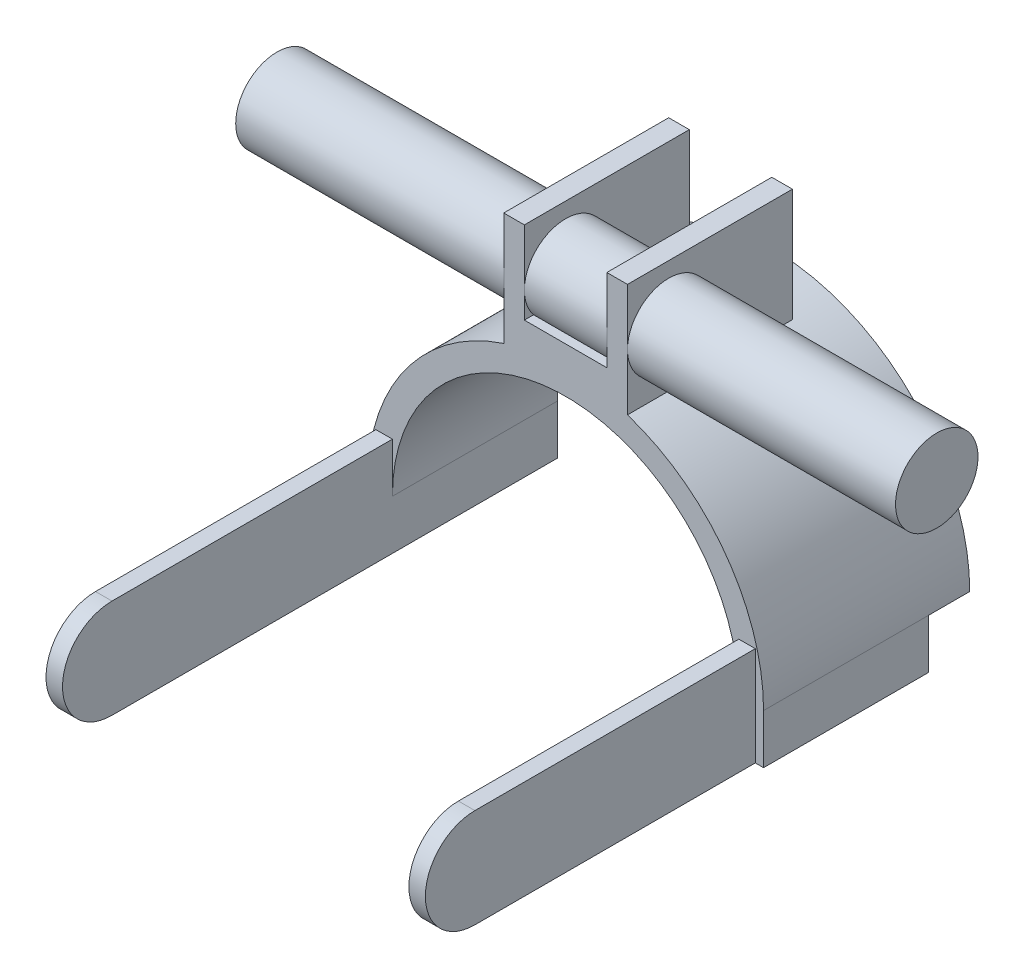
ISO-10303-21;
HEADER;
FILE_DESCRIPTION(('STEP AP214'),'2;1');
FILE_NAME('part.step','',(''),(''),'','','');
FILE_SCHEMA(('AUTOMOTIVE_DESIGN { 1 0 10303 214 1 1 1 1 }'));
ENDSEC;
DATA;
#1=APPLICATION_CONTEXT('core data for automotive mechanical design processes');
#2=APPLICATION_PROTOCOL_DEFINITION('international standard','automotive_design',2000,#1);
#3=PRODUCT_CONTEXT('',#1,'mechanical');
#4=PRODUCT('Part','Part','',(#3));
#5=PRODUCT_RELATED_PRODUCT_CATEGORY('part','',(#4));
#6=PRODUCT_DEFINITION_FORMATION('','',#4);
#7=PRODUCT_DEFINITION_CONTEXT('part definition',#1,'design');
#8=PRODUCT_DEFINITION('design','',#6,#7);
#9=PRODUCT_DEFINITION_SHAPE('','',#8);
#10=(LENGTH_UNIT() NAMED_UNIT(*) SI_UNIT(.MILLI.,.METRE.));
#11=(NAMED_UNIT(*) PLANE_ANGLE_UNIT() SI_UNIT($,.RADIAN.));
#12=(NAMED_UNIT(*) SI_UNIT($,.STERADIAN.) SOLID_ANGLE_UNIT());
#13=UNCERTAINTY_MEASURE_WITH_UNIT(LENGTH_MEASURE(1.E-05),#10,'distance_accuracy_value','');
#14=(GEOMETRIC_REPRESENTATION_CONTEXT(3) GLOBAL_UNCERTAINTY_ASSIGNED_CONTEXT((#13)) GLOBAL_UNIT_ASSIGNED_CONTEXT((#10,
#11,#12)) REPRESENTATION_CONTEXT('',''));
#15=CARTESIAN_POINT('',(0.,0.,0.));
#16=DIRECTION('',(0.,0.,1.));
#17=DIRECTION('',(1.,0.,0.));
#18=AXIS2_PLACEMENT_3D('',#15,#16,#17);
#19=CARTESIAN_POINT('',(10.,73.,50.));
#20=DIRECTION('',(1.,0.,0.));
#21=DIRECTION('',(0.,0.,-1.));
#22=AXIS2_PLACEMENT_3D('',#19,#20,#21);
#23=PLANE('',#22);
#24=CARTESIAN_POINT('',(9.99999999999999,59.298026230356,40.));
#25=DIRECTION('',(1.,0.,0.));
#26=DIRECTION('',(0.,0.,-1.));
#27=AXIS2_PLACEMENT_3D('',#24,#25,#26);
#28=CIRCLE('',#27,10.);
#29=CARTESIAN_POINT('',(10.,53.,47.7675520984251));
#30=VERTEX_POINT('',#29);
#31=CARTESIAN_POINT('',(10.,59.298026230356,50.));
#32=VERTEX_POINT('',#31);
#33=EDGE_CURVE('E57',#30,#32,#28,.F.);
#34=ORIENTED_EDGE('',*,*,#33,.F.);
#35=DIRECTION('',(0.,0.,-1.));
#36=VECTOR('',#35,1.);
#37=CARTESIAN_POINT('',(10.,53.,50.));
#38=LINE('',#37,#36);
#39=CARTESIAN_POINT('',(10.,53.,50.));
#40=VERTEX_POINT('',#39);
#41=EDGE_CURVE('E302',#40,#30,#38,.T.);
#42=ORIENTED_EDGE('',*,*,#41,.F.);
#43=DIRECTION('',(0.,-1.,0.));
#44=VECTOR('',#43,1.);
#45=CARTESIAN_POINT('',(10.,73.,50.));
#46=LINE('',#45,#44);
#47=EDGE_CURVE('E252',#32,#40,#46,.T.);
#48=ORIENTED_EDGE('',*,*,#47,.F.);
#49=EDGE_LOOP('',(#34,#42,#48));
#50=FACE_BOUND('',#49,.T.);
#51=ADVANCED_FACE('F34',(#50),#23,.F.);
#52=CARTESIAN_POINT('',(-10.,53.,50.));
#53=DIRECTION('',(0.,-1.,0.));
#54=DIRECTION('',(0.,0.,-1.));
#55=AXIS2_PLACEMENT_3D('',#52,#53,#54);
#56=PLANE('',#55);
#57=DIRECTION('',(-1.,0.,0.));
#58=VECTOR('',#57,1.);
#59=CARTESIAN_POINT('',(80.,53.,47.7675520984251));
#60=LINE('',#59,#58);
#61=CARTESIAN_POINT('',(-9.99999999999999,53.,47.7675520984251));
#62=VERTEX_POINT('',#61);
#63=EDGE_CURVE('E467',#62,#30,#60,.F.);
#64=ORIENTED_EDGE('',*,*,#63,.F.);
#65=DIRECTION('',(0.,0.,-1.));
#66=VECTOR('',#65,1.);
#67=CARTESIAN_POINT('',(-10.,53.,50.));
#68=LINE('',#67,#66);
#69=CARTESIAN_POINT('',(-10.,53.,50.));
#70=VERTEX_POINT('',#69);
#71=EDGE_CURVE('E299',#70,#62,#68,.T.);
#72=ORIENTED_EDGE('',*,*,#71,.F.);
#73=DIRECTION('',(-1.,0.,0.));
#74=VECTOR('',#73,1.);
#75=CARTESIAN_POINT('',(-10.,53.,50.));
#76=LINE('',#75,#74);
#77=EDGE_CURVE('E255',#40,#70,#76,.T.);
#78=ORIENTED_EDGE('',*,*,#77,.F.);
#79=ORIENTED_EDGE('',*,*,#41,.T.);
#80=EDGE_LOOP('',(#64,#72,#78,#79));
#81=FACE_BOUND('',#80,.T.);
#82=ADVANCED_FACE('F510',(#81),#56,.F.);
#83=DIRECTION('',(-1.,0.,0.));
#84=VECTOR('',#83,1.);
#85=CARTESIAN_POINT('',(80.,53.,32.2324479015749));
#86=LINE('',#85,#84);
#87=CARTESIAN_POINT('',(10.,53.,32.2324479015749));
#88=VERTEX_POINT('',#87);
#89=CARTESIAN_POINT('',(-9.99999999999999,53.,32.2324479015749));
#90=VERTEX_POINT('',#89);
#91=EDGE_CURVE('E49',#88,#90,#86,.T.);
#92=ORIENTED_EDGE('',*,*,#91,.F.);
#93=CARTESIAN_POINT('',(10.,53.,10.));
#94=VERTEX_POINT('',#93);
#95=EDGE_CURVE('E301',#88,#94,#38,.T.);
#96=ORIENTED_EDGE('',*,*,#95,.T.);
#97=DIRECTION('',(-1.,0.,0.));
#98=VECTOR('',#97,1.);
#99=CARTESIAN_POINT('',(-10.,53.,10.));
#100=LINE('',#99,#98);
#101=CARTESIAN_POINT('',(-10.,53.,10.));
#102=VERTEX_POINT('',#101);
#103=EDGE_CURVE('E285',#94,#102,#100,.T.);
#104=ORIENTED_EDGE('',*,*,#103,.T.);
#105=EDGE_CURVE('E298',#90,#102,#68,.T.);
#106=ORIENTED_EDGE('',*,*,#105,.F.);
#107=EDGE_LOOP('',(#92,#96,#104,#106));
#108=FACE_BOUND('',#107,.T.);
#109=ADVANCED_FACE('F516',(#108),#56,.F.);
#110=CARTESIAN_POINT('',(-10.,73.,50.));
#111=DIRECTION('',(-1.,0.,0.));
#112=DIRECTION('',(0.,-1.,0.));
#113=AXIS2_PLACEMENT_3D('',#110,#111,#112);
#114=PLANE('',#113);
#115=CARTESIAN_POINT('',(-9.99999999999999,59.298026230356,40.));
#116=DIRECTION('',(-1.,0.,0.));
#117=DIRECTION('',(0.,-1.,0.));
#118=AXIS2_PLACEMENT_3D('',#115,#116,#117);
#119=CIRCLE('',#118,10.);
#120=CARTESIAN_POINT('',(-10.,59.298026230356,50.));
#121=VERTEX_POINT('',#120);
#122=EDGE_CURVE('E474',#90,#121,#119,.F.);
#123=ORIENTED_EDGE('',*,*,#122,.F.);
#124=ORIENTED_EDGE('',*,*,#105,.T.);
#125=DIRECTION('',(0.,1.,0.));
#126=VECTOR('',#125,1.);
#127=CARTESIAN_POINT('',(-10.,73.,10.));
#128=LINE('',#127,#126);
#129=CARTESIAN_POINT('',(-10.,73.,10.));
#130=VERTEX_POINT('',#129);
#131=EDGE_CURVE('E288',#102,#130,#128,.T.);
#132=ORIENTED_EDGE('',*,*,#131,.T.);
#133=DIRECTION('',(0.,0.,-1.));
#134=VECTOR('',#133,1.);
#135=CARTESIAN_POINT('',(-10.,73.,50.));
#136=LINE('',#135,#134);
#137=CARTESIAN_POINT('',(-10.,73.,50.));
#138=VERTEX_POINT('',#137);
#139=EDGE_CURVE('E295',#138,#130,#136,.T.);
#140=ORIENTED_EDGE('',*,*,#139,.F.);
#141=DIRECTION('',(0.,1.,0.));
#142=VECTOR('',#141,1.);
#143=CARTESIAN_POINT('',(-10.,73.,50.));
#144=LINE('',#143,#142);
#145=EDGE_CURVE('E257',#121,#138,#144,.T.);
#146=ORIENTED_EDGE('',*,*,#145,.F.);
#147=EDGE_LOOP('',(#123,#124,#132,#140,#146));
#148=FACE_BOUND('',#147,.T.);
#149=ADVANCED_FACE('F531',(#148),#114,.F.);
#150=CARTESIAN_POINT('',(-48.,-12.,50.));
#151=DIRECTION('',(0.,1.,0.));
#152=DIRECTION('',(0.,0.,1.));
#153=AXIS2_PLACEMENT_3D('',#150,#151,#152);
#154=PLANE('',#153);
#155=DIRECTION('',(-1.,0.,0.));
#156=VECTOR('',#155,1.);
#157=CARTESIAN_POINT('',(48.,-12.,118.));
#158=LINE('',#157,#156);
#159=CARTESIAN_POINT('',(-42.,-12.,118.));
#160=VERTEX_POINT('',#159);
#161=CARTESIAN_POINT('',(-46.,-12.,118.));
#162=VERTEX_POINT('',#161);
#163=EDGE_CURVE('E459',#160,#162,#158,.T.);
#164=ORIENTED_EDGE('',*,*,#163,.T.);
#165=DIRECTION('',(0.,0.,-1.));
#166=VECTOR('',#165,1.);
#167=CARTESIAN_POINT('',(-46.,-12.,130.));
#168=LINE('',#167,#166);
#169=CARTESIAN_POINT('',(-46.,-12.,50.));
#170=VERTEX_POINT('',#169);
#171=EDGE_CURVE('E441',#162,#170,#168,.T.);
#172=ORIENTED_EDGE('',*,*,#171,.T.);
#173=DIRECTION('',(1.,0.,0.));
#174=VECTOR('',#173,1.);
#175=CARTESIAN_POINT('',(-48.,-12.,50.));
#176=LINE('',#175,#174);
#177=CARTESIAN_POINT('',(-48.,-12.,50.));
#178=VERTEX_POINT('',#177);
#179=EDGE_CURVE('E397',#178,#170,#176,.T.);
#180=ORIENTED_EDGE('',*,*,#179,.F.);
#181=DIRECTION('',(0.,0.,-1.));
#182=VECTOR('',#181,1.);
#183=CARTESIAN_POINT('',(-48.,-12.,50.));
#184=LINE('',#183,#182);
#185=CARTESIAN_POINT('',(-48.,-12.,10.));
#186=VERTEX_POINT('',#185);
#187=EDGE_CURVE('E316',#178,#186,#184,.T.);
#188=ORIENTED_EDGE('',*,*,#187,.T.);
#189=DIRECTION('',(1.,0.,0.));
#190=VECTOR('',#189,1.);
#191=CARTESIAN_POINT('',(-48.,-12.,10.));
#192=LINE('',#191,#190);
#193=CARTESIAN_POINT('',(-42.,-12.,10.));
#194=VERTEX_POINT('',#193);
#195=EDGE_CURVE('E270',#186,#194,#192,.T.);
#196=ORIENTED_EDGE('',*,*,#195,.T.);
#197=DIRECTION('',(0.,0.,-1.));
#198=VECTOR('',#197,1.);
#199=CARTESIAN_POINT('',(-42.,-12.,130.));
#200=LINE('',#199,#198);
#201=EDGE_CURVE('E447',#160,#194,#200,.T.);
#202=ORIENTED_EDGE('',*,*,#201,.F.);
#203=EDGE_LOOP('',(#164,#172,#180,#188,#196,#202));
#204=FACE_BOUND('',#203,.T.);
#205=ADVANCED_FACE('F569',(#204),#154,.F.);
#206=CARTESIAN_POINT('',(46.,-12.,50.));
#207=DIRECTION('',(0.,1.,0.));
#208=DIRECTION('',(0.,0.,1.));
#209=AXIS2_PLACEMENT_3D('',#206,#207,#208);
#210=PLANE('',#209);
#211=CARTESIAN_POINT('',(46.,-12.,118.));
#212=VERTEX_POINT('',#211);
#213=CARTESIAN_POINT('',(42.,-12.,118.));
#214=VERTEX_POINT('',#213);
#215=EDGE_CURVE('E415',#212,#214,#158,.T.);
#216=ORIENTED_EDGE('',*,*,#215,.T.);
#217=DIRECTION('',(0.,0.,-1.));
#218=VECTOR('',#217,1.);
#219=CARTESIAN_POINT('',(42.,-12.,130.));
#220=LINE('',#219,#218);
#221=CARTESIAN_POINT('',(42.,-12.,10.));
#222=VERTEX_POINT('',#221);
#223=EDGE_CURVE('E414',#214,#222,#220,.T.);
#224=ORIENTED_EDGE('',*,*,#223,.T.);
#225=DIRECTION('',(1.,0.,0.));
#226=VECTOR('',#225,1.);
#227=CARTESIAN_POINT('',(46.,-12.,10.));
#228=LINE('',#227,#226);
#229=CARTESIAN_POINT('',(48.,-12.,10.));
#230=VERTEX_POINT('',#229);
#231=EDGE_CURVE('E273',#222,#230,#228,.T.);
#232=ORIENTED_EDGE('',*,*,#231,.T.);
#233=DIRECTION('',(0.,0.,-1.));
#234=VECTOR('',#233,1.);
#235=CARTESIAN_POINT('',(48.,-12.,50.));
#236=LINE('',#235,#234);
#237=CARTESIAN_POINT('',(48.,-12.,50.));
#238=VERTEX_POINT('',#237);
#239=EDGE_CURVE('E313',#238,#230,#236,.T.);
#240=ORIENTED_EDGE('',*,*,#239,.F.);
#241=DIRECTION('',(1.,0.,0.));
#242=VECTOR('',#241,1.);
#243=CARTESIAN_POINT('',(46.,-12.,50.));
#244=LINE('',#243,#242);
#245=CARTESIAN_POINT('',(46.,-12.,50.));
#246=VERTEX_POINT('',#245);
#247=EDGE_CURVE('E406',#246,#238,#244,.T.);
#248=ORIENTED_EDGE('',*,*,#247,.F.);
#249=DIRECTION('',(0.,0.,-1.));
#250=VECTOR('',#249,1.);
#251=CARTESIAN_POINT('',(46.,-12.,130.));
#252=LINE('',#251,#250);
#253=EDGE_CURVE('E419',#212,#246,#252,.T.);
#254=ORIENTED_EDGE('',*,*,#253,.F.);
#255=EDGE_LOOP('',(#216,#224,#232,#240,#248,#254));
#256=FACE_BOUND('',#255,.T.);
#257=ADVANCED_FACE('F412',(#256),#210,.F.);
#258=CARTESIAN_POINT('',(46.,12.,130.));
#259=DIRECTION('',(0.,1.,0.));
#260=DIRECTION('',(0.,0.,1.));
#261=AXIS2_PLACEMENT_3D('',#258,#259,#260);
#262=PLANE('',#261);
#263=DIRECTION('',(0.,0.,-1.));
#264=VECTOR('',#263,1.);
#265=CARTESIAN_POINT('',(42.,12.,130.));
#266=LINE('',#265,#264);
#267=CARTESIAN_POINT('',(42.,12.,118.));
#268=VERTEX_POINT('',#267);
#269=CARTESIAN_POINT('',(42.,12.,50.));
#270=VERTEX_POINT('',#269);
#271=EDGE_CURVE('E418',#268,#270,#266,.T.);
#272=ORIENTED_EDGE('',*,*,#271,.F.);
#273=DIRECTION('',(-1.,0.,0.));
#274=VECTOR('',#273,1.);
#275=CARTESIAN_POINT('',(48.,12.,118.));
#276=LINE('',#275,#274);
#277=CARTESIAN_POINT('',(46.,12.,118.));
#278=VERTEX_POINT('',#277);
#279=EDGE_CURVE('E458',#278,#268,#276,.T.);
#280=ORIENTED_EDGE('',*,*,#279,.F.);
#281=DIRECTION('',(0.,0.,-1.));
#282=VECTOR('',#281,1.);
#283=CARTESIAN_POINT('',(46.,12.,130.));
#284=LINE('',#283,#282);
#285=CARTESIAN_POINT('',(46.,12.,50.));
#286=VERTEX_POINT('',#285);
#287=EDGE_CURVE('E421',#278,#286,#284,.T.);
#288=ORIENTED_EDGE('',*,*,#287,.T.);
#289=DIRECTION('',(1.,0.,0.));
#290=VECTOR('',#289,1.);
#291=CARTESIAN_POINT('',(0.,12.,50.));
#292=LINE('',#291,#290);
#293=EDGE_CURVE('E376',#270,#286,#292,.T.);
#294=ORIENTED_EDGE('',*,*,#293,.F.);
#295=EDGE_LOOP('',(#272,#280,#288,#294));
#296=FACE_BOUND('',#295,.T.);
#297=ADVANCED_FACE('F592',(#296),#262,.T.);
#298=CARTESIAN_POINT('',(-46.,12.,130.));
#299=DIRECTION('',(0.,1.,0.));
#300=DIRECTION('',(0.,0.,1.));
#301=AXIS2_PLACEMENT_3D('',#298,#299,#300);
#302=PLANE('',#301);
#303=DIRECTION('',(0.,0.,-1.));
#304=VECTOR('',#303,1.);
#305=CARTESIAN_POINT('',(-46.,12.,130.));
#306=LINE('',#305,#304);
#307=CARTESIAN_POINT('',(-46.,12.,118.));
#308=VERTEX_POINT('',#307);
#309=CARTESIAN_POINT('',(-46.,12.,50.));
#310=VERTEX_POINT('',#309);
#311=EDGE_CURVE('E442',#308,#310,#306,.T.);
#312=ORIENTED_EDGE('',*,*,#311,.F.);
#313=CARTESIAN_POINT('',(-42.,12.,118.));
#314=VERTEX_POINT('',#313);
#315=EDGE_CURVE('E463',#314,#308,#276,.T.);
#316=ORIENTED_EDGE('',*,*,#315,.F.);
#317=DIRECTION('',(0.,0.,-1.));
#318=VECTOR('',#317,1.);
#319=CARTESIAN_POINT('',(-42.,12.,130.));
#320=LINE('',#319,#318);
#321=CARTESIAN_POINT('',(-42.,12.,50.));
#322=VERTEX_POINT('',#321);
#323=EDGE_CURVE('E444',#314,#322,#320,.T.);
#324=ORIENTED_EDGE('',*,*,#323,.T.);
#325=DIRECTION('',(1.,0.,0.));
#326=VECTOR('',#325,1.);
#327=CARTESIAN_POINT('',(0.,12.,50.));
#328=LINE('',#327,#326);
#329=EDGE_CURVE('E435',#310,#322,#328,.T.);
#330=ORIENTED_EDGE('',*,*,#329,.F.);
#331=EDGE_LOOP('',(#312,#316,#324,#330));
#332=FACE_BOUND('',#331,.T.);
#333=ADVANCED_FACE('F578',(#332),#302,.T.);
#334=CARTESIAN_POINT('',(0.,0.,10.));
#335=DIRECTION('',(0.,0.,-1.));
#336=DIRECTION('',(-1.,0.,0.));
#337=AXIS2_PLACEMENT_3D('',#334,#335,#336);
#338=CYLINDRICAL_SURFACE('',#337,46.);
#339=CARTESIAN_POINT('',(0.,0.,10.));
#340=DIRECTION('',(0.,0.,-1.));
#341=DIRECTION('',(1.,0.,0.));
#342=AXIS2_PLACEMENT_3D('',#339,#340,#341);
#343=CIRCLE('',#342,46.);
#344=CARTESIAN_POINT('',(-46.,0.,10.));
#345=VERTEX_POINT('',#344);
#346=CARTESIAN_POINT('',(46.,0.,10.));
#347=VERTEX_POINT('',#346);
#348=EDGE_CURVE('E353',#345,#347,#343,.T.);
#349=ORIENTED_EDGE('',*,*,#348,.F.);
#350=DIRECTION('',(0.,0.,-1.));
#351=VECTOR('',#350,1.);
#352=CARTESIAN_POINT('',(-46.,0.,10.));
#353=LINE('',#352,#351);
#354=CARTESIAN_POINT('',(-46.,0.,0.));
#355=VERTEX_POINT('',#354);
#356=EDGE_CURVE('E42',#345,#355,#353,.T.);
#357=ORIENTED_EDGE('',*,*,#356,.T.);
#358=CARTESIAN_POINT('',(0.,0.,0.));
#359=DIRECTION('',(0.,0.,-1.));
#360=DIRECTION('',(-1.,0.,0.));
#361=AXIS2_PLACEMENT_3D('',#358,#359,#360);
#362=CIRCLE('',#361,46.);
#363=CARTESIAN_POINT('',(46.,0.,0.));
#364=VERTEX_POINT('',#363);
#365=EDGE_CURVE('E340',#355,#364,#362,.T.);
#366=ORIENTED_EDGE('',*,*,#365,.T.);
#367=DIRECTION('',(0.,0.,-1.));
#368=VECTOR('',#367,1.);
#369=CARTESIAN_POINT('',(46.,0.,10.));
#370=LINE('',#369,#368);
#371=EDGE_CURVE('E345',#347,#364,#370,.T.);
#372=ORIENTED_EDGE('',*,*,#371,.F.);
#373=EDGE_LOOP('',(#349,#357,#366,#372));
#374=FACE_BOUND('',#373,.T.);
#375=ADVANCED_FACE('F351',(#374),#338,.F.);
#376=CARTESIAN_POINT('',(0.,0.,10.));
#377=DIRECTION('',(0.,0.,-1.));
#378=DIRECTION('',(-1.,0.,0.));
#379=AXIS2_PLACEMENT_3D('',#376,#377,#378);
#380=CYLINDRICAL_SURFACE('',#379,48.);
#381=CARTESIAN_POINT('',(0.,0.,0.));
#382=DIRECTION('',(0.,0.,1.));
#383=DIRECTION('',(-1.,0.,0.));
#384=AXIS2_PLACEMENT_3D('',#381,#382,#383);
#385=CIRCLE('',#384,48.);
#386=CARTESIAN_POINT('',(48.,0.,0.));
#387=VERTEX_POINT('',#386);
#388=CARTESIAN_POINT('',(-48.,0.,0.));
#389=VERTEX_POINT('',#388);
#390=EDGE_CURVE('E325',#387,#389,#385,.T.);
#391=ORIENTED_EDGE('',*,*,#390,.T.);
#392=DIRECTION('',(0.,0.,-1.));
#393=VECTOR('',#392,1.);
#394=CARTESIAN_POINT('',(-48.,0.,10.));
#395=LINE('',#394,#393);
#396=CARTESIAN_POINT('',(-48.,0.,10.));
#397=VERTEX_POINT('',#396);
#398=EDGE_CURVE('E11',#397,#389,#395,.T.);
#399=ORIENTED_EDGE('',*,*,#398,.F.);
#400=DIRECTION('',(0.,0.,-1.));
#401=VECTOR('',#400,1.);
#402=CARTESIAN_POINT('',(-48.,0.,50.));
#403=LINE('',#402,#401);
#404=CARTESIAN_POINT('',(-48.,0.,50.));
#405=VERTEX_POINT('',#404);
#406=EDGE_CURVE('E319',#405,#397,#403,.T.);
#407=ORIENTED_EDGE('',*,*,#406,.F.);
#408=CARTESIAN_POINT('',(0.,0.,50.));
#409=DIRECTION('',(0.,0.,1.));
#410=DIRECTION('',(-1.,0.,0.));
#411=AXIS2_PLACEMENT_3D('',#408,#409,#410);
#412=CIRCLE('',#411,48.);
#413=CARTESIAN_POINT('',(-15.,45.596052460712,50.));
#414=VERTEX_POINT('',#413);
#415=EDGE_CURVE('E393',#414,#405,#412,.T.);
#416=ORIENTED_EDGE('',*,*,#415,.F.);
#417=DIRECTION('',(0.,0.,-1.));
#418=VECTOR('',#417,1.);
#419=CARTESIAN_POINT('',(-15.,45.596052460712,50.));
#420=LINE('',#419,#418);
#421=CARTESIAN_POINT('',(-15.,45.596052460712,10.));
#422=VERTEX_POINT('',#421);
#423=EDGE_CURVE('E322',#414,#422,#420,.T.);
#424=ORIENTED_EDGE('',*,*,#423,.T.);
#425=CARTESIAN_POINT('',(0.,0.,10.));
#426=DIRECTION('',(0.,0.,1.));
#427=DIRECTION('',(-1.,0.,0.));
#428=AXIS2_PLACEMENT_3D('',#425,#426,#427);
#429=CIRCLE('',#428,48.);
#430=CARTESIAN_POINT('',(15.,45.596052460712,10.));
#431=VERTEX_POINT('',#430);
#432=EDGE_CURVE('E326',#431,#422,#429,.T.);
#433=ORIENTED_EDGE('',*,*,#432,.F.);
#434=DIRECTION('',(0.,0.,-1.));
#435=VECTOR('',#434,1.);
#436=CARTESIAN_POINT('',(15.,45.596052460712,50.));
#437=LINE('',#436,#435);
#438=CARTESIAN_POINT('',(15.,45.596052460712,50.));
#439=VERTEX_POINT('',#438);
#440=EDGE_CURVE('E308',#439,#431,#437,.T.);
#441=ORIENTED_EDGE('',*,*,#440,.F.);
#442=CARTESIAN_POINT('',(0.,0.,50.));
#443=DIRECTION('',(0.,0.,1.));
#444=DIRECTION('',(-1.,0.,0.));
#445=AXIS2_PLACEMENT_3D('',#442,#443,#444);
#446=CIRCLE('',#445,48.);
#447=CARTESIAN_POINT('',(48.,0.,50.));
#448=VERTEX_POINT('',#447);
#449=EDGE_CURVE('E234',#448,#439,#446,.T.);
#450=ORIENTED_EDGE('',*,*,#449,.F.);
#451=DIRECTION('',(0.,0.,-1.));
#452=VECTOR('',#451,1.);
#453=CARTESIAN_POINT('',(48.,0.,50.));
#454=LINE('',#453,#452);
#455=CARTESIAN_POINT('',(48.,0.,10.));
#456=VERTEX_POINT('',#455);
#457=EDGE_CURVE('E310',#448,#456,#454,.T.);
#458=ORIENTED_EDGE('',*,*,#457,.T.);
#459=DIRECTION('',(0.,0.,-1.));
#460=VECTOR('',#459,1.);
#461=CARTESIAN_POINT('',(48.,0.,10.));
#462=LINE('',#461,#460);
#463=EDGE_CURVE('E335',#456,#387,#462,.T.);
#464=ORIENTED_EDGE('',*,*,#463,.T.);
#465=EDGE_LOOP('',(#391,#399,#407,#416,#424,#433,#441,#450,#458,#464));
#466=FACE_BOUND('',#465,.T.);
#467=ADVANCED_FACE('F36',(#466),#380,.T.);
#468=CARTESIAN_POINT('',(-48.,0.,10.));
#469=DIRECTION('',(0.,1.,0.));
#470=DIRECTION('',(0.,0.,1.));
#471=AXIS2_PLACEMENT_3D('',#468,#469,#470);
#472=PLANE('',#471);
#473=DIRECTION('',(1.,0.,0.));
#474=VECTOR('',#473,1.);
#475=CARTESIAN_POINT('',(-48.,0.,0.));
#476=LINE('',#475,#474);
#477=EDGE_CURVE('E338',#389,#355,#476,.T.);
#478=ORIENTED_EDGE('',*,*,#477,.T.);
#479=ORIENTED_EDGE('',*,*,#356,.F.);
#480=DIRECTION('',(1.,0.,0.));
#481=VECTOR('',#480,1.);
#482=CARTESIAN_POINT('',(-48.,0.,10.));
#483=LINE('',#482,#481);
#484=EDGE_CURVE('E328',#397,#345,#483,.T.);
#485=ORIENTED_EDGE('',*,*,#484,.F.);
#486=ORIENTED_EDGE('',*,*,#398,.T.);
#487=EDGE_LOOP('',(#478,#479,#485,#486));
#488=FACE_BOUND('',#487,.T.);
#489=ADVANCED_FACE('F761',(#488),#472,.F.);
#490=CARTESIAN_POINT('',(48.,0.,10.));
#491=DIRECTION('',(0.,1.,0.));
#492=DIRECTION('',(0.,0.,1.));
#493=AXIS2_PLACEMENT_3D('',#490,#491,#492);
#494=PLANE('',#493);
#495=DIRECTION('',(1.,0.,0.));
#496=VECTOR('',#495,1.);
#497=CARTESIAN_POINT('',(48.,0.,0.));
#498=LINE('',#497,#496);
#499=EDGE_CURVE('E329',#364,#387,#498,.T.);
#500=ORIENTED_EDGE('',*,*,#499,.T.);
#501=ORIENTED_EDGE('',*,*,#463,.F.);
#502=DIRECTION('',(1.,0.,0.));
#503=VECTOR('',#502,1.);
#504=CARTESIAN_POINT('',(48.,0.,10.));
#505=LINE('',#504,#503);
#506=EDGE_CURVE('E332',#347,#456,#505,.T.);
#507=ORIENTED_EDGE('',*,*,#506,.F.);
#508=ORIENTED_EDGE('',*,*,#371,.T.);
#509=EDGE_LOOP('',(#500,#501,#507,#508));
#510=FACE_BOUND('',#509,.T.);
#511=ADVANCED_FACE('F360',(#510),#494,.F.);
#512=CARTESIAN_POINT('',(0.,0.,0.));
#513=DIRECTION('',(0.,0.,-1.));
#514=DIRECTION('',(-1.,0.,0.));
#515=AXIS2_PLACEMENT_3D('',#512,#513,#514);
#516=PLANE('',#515);
#517=ORIENTED_EDGE('',*,*,#390,.F.);
#518=ORIENTED_EDGE('',*,*,#499,.F.);
#519=ORIENTED_EDGE('',*,*,#365,.F.);
#520=ORIENTED_EDGE('',*,*,#477,.F.);
#521=EDGE_LOOP('',(#517,#518,#519,#520));
#522=FACE_BOUND('',#521,.T.);
#523=ADVANCED_FACE('F358',(#522),#516,.T.);
#524=CARTESIAN_POINT('',(0.,0.,10.));
#525=DIRECTION('',(0.,0.,-1.));
#526=DIRECTION('',(-1.,0.,0.));
#527=AXIS2_PLACEMENT_3D('',#524,#525,#526);
#528=PLANE('',#527);
#529=DIRECTION('',(0.,1.,0.));
#530=VECTOR('',#529,1.);
#531=CARTESIAN_POINT('',(15.,73.,10.));
#532=LINE('',#531,#530);
#533=CARTESIAN_POINT('',(15.,73.,10.));
#534=VERTEX_POINT('',#533);
#535=EDGE_CURVE('E278',#431,#534,#532,.T.);
#536=ORIENTED_EDGE('',*,*,#535,.F.);
#537=ORIENTED_EDGE('',*,*,#432,.T.);
#538=DIRECTION('',(0.,-1.,0.));
#539=VECTOR('',#538,1.);
#540=CARTESIAN_POINT('',(-15.,73.,10.));
#541=LINE('',#540,#539);
#542=CARTESIAN_POINT('',(-15.,73.,10.));
#543=VERTEX_POINT('',#542);
#544=EDGE_CURVE('E264',#543,#422,#541,.T.);
#545=ORIENTED_EDGE('',*,*,#544,.F.);
#546=DIRECTION('',(-1.,0.,0.));
#547=VECTOR('',#546,1.);
#548=CARTESIAN_POINT('',(-15.,73.,10.));
#549=LINE('',#548,#547);
#550=EDGE_CURVE('E290',#130,#543,#549,.T.);
#551=ORIENTED_EDGE('',*,*,#550,.F.);
#552=ORIENTED_EDGE('',*,*,#131,.F.);
#553=ORIENTED_EDGE('',*,*,#103,.F.);
#554=DIRECTION('',(0.,-1.,0.));
#555=VECTOR('',#554,1.);
#556=CARTESIAN_POINT('',(10.,73.,10.));
#557=LINE('',#556,#555);
#558=CARTESIAN_POINT('',(10.,73.,10.));
#559=VERTEX_POINT('',#558);
#560=EDGE_CURVE('E282',#559,#94,#557,.T.);
#561=ORIENTED_EDGE('',*,*,#560,.F.);
#562=DIRECTION('',(-1.,0.,0.));
#563=VECTOR('',#562,1.);
#564=CARTESIAN_POINT('',(10.,73.,10.));
#565=LINE('',#564,#563);
#566=EDGE_CURVE('E280',#534,#559,#565,.T.);
#567=ORIENTED_EDGE('',*,*,#566,.F.);
#568=EDGE_LOOP('',(#536,#537,#545,#551,#552,#553,#561,#567));
#569=FACE_BOUND('',#568,.T.);
#570=ADVANCED_FACE('F549',(#569),#528,.T.);
#571=DIRECTION('',(0.,-1.,0.));
#572=VECTOR('',#571,1.);
#573=CARTESIAN_POINT('',(-48.,0.,10.));
#574=LINE('',#573,#572);
#575=EDGE_CURVE('E267',#397,#186,#574,.T.);
#576=ORIENTED_EDGE('',*,*,#575,.F.);
#577=ORIENTED_EDGE('',*,*,#484,.T.);
#578=ORIENTED_EDGE('',*,*,#348,.T.);
#579=ORIENTED_EDGE('',*,*,#506,.T.);
#580=DIRECTION('',(0.,1.,0.));
#581=VECTOR('',#580,1.);
#582=CARTESIAN_POINT('',(48.,0.,10.));
#583=LINE('',#582,#581);
#584=EDGE_CURVE('E275',#230,#456,#583,.T.);
#585=ORIENTED_EDGE('',*,*,#584,.F.);
#586=ORIENTED_EDGE('',*,*,#231,.F.);
#587=DIRECTION('',(0.,1.,0.));
#588=VECTOR('',#587,1.);
#589=CARTESIAN_POINT('',(42.,-12.,10.));
#590=LINE('',#589,#588);
#591=CARTESIAN_POINT('',(42.,0.,10.));
#592=VERTEX_POINT('',#591);
#593=EDGE_CURVE('E423',#222,#592,#590,.T.);
#594=ORIENTED_EDGE('',*,*,#593,.T.);
#595=CARTESIAN_POINT('',(0.,0.,10.));
#596=DIRECTION('',(0.,0.,1.));
#597=DIRECTION('',(1.,0.,0.));
#598=AXIS2_PLACEMENT_3D('',#595,#596,#597);
#599=CIRCLE('',#598,42.);
#600=CARTESIAN_POINT('',(-42.,0.,10.));
#601=VERTEX_POINT('',#600);
#602=EDGE_CURVE('E375',#592,#601,#599,.T.);
#603=ORIENTED_EDGE('',*,*,#602,.T.);
#604=DIRECTION('',(0.,-1.,0.));
#605=VECTOR('',#604,1.);
#606=CARTESIAN_POINT('',(-42.,-12.,10.));
#607=LINE('',#606,#605);
#608=EDGE_CURVE('E445',#601,#194,#607,.T.);
#609=ORIENTED_EDGE('',*,*,#608,.T.);
#610=ORIENTED_EDGE('',*,*,#195,.F.);
#611=EDGE_LOOP('',(#576,#577,#578,#579,#585,#586,#594,#603,#609,#610));
#612=FACE_BOUND('',#611,.T.);
#613=ADVANCED_FACE('F373',(#612),#528,.T.);
#614=CARTESIAN_POINT('',(-15.,73.,50.));
#615=DIRECTION('',(1.,0.,0.));
#616=DIRECTION('',(0.,1.,0.));
#617=AXIS2_PLACEMENT_3D('',#614,#615,#616);
#618=PLANE('',#617);
#619=DIRECTION('',(0.,-1.,0.));
#620=VECTOR('',#619,1.);
#621=CARTESIAN_POINT('',(-15.,73.,50.));
#622=LINE('',#621,#620);
#623=CARTESIAN_POINT('',(-15.,59.298026230356,50.));
#624=VERTEX_POINT('',#623);
#625=EDGE_CURVE('E292',#624,#414,#622,.T.);
#626=ORIENTED_EDGE('',*,*,#625,.F.);
#627=CARTESIAN_POINT('',(-15.,59.298026230356,40.));
#628=DIRECTION('',(1.,0.,0.));
#629=DIRECTION('',(0.,1.,0.));
#630=AXIS2_PLACEMENT_3D('',#627,#628,#629);
#631=CIRCLE('',#630,10.);
#632=EDGE_CURVE('E471',#624,#624,#631,.F.);
#633=ORIENTED_EDGE('',*,*,#632,.F.);
#634=CARTESIAN_POINT('',(-15.,73.,50.));
#635=VERTEX_POINT('',#634);
#636=EDGE_CURVE('E391',#635,#624,#622,.T.);
#637=ORIENTED_EDGE('',*,*,#636,.F.);
#638=DIRECTION('',(0.,0.,-1.));
#639=VECTOR('',#638,1.);
#640=CARTESIAN_POINT('',(-15.,73.,50.));
#641=LINE('',#640,#639);
#642=EDGE_CURVE('E263',#635,#543,#641,.T.);
#643=ORIENTED_EDGE('',*,*,#642,.T.);
#644=ORIENTED_EDGE('',*,*,#544,.T.);
#645=ORIENTED_EDGE('',*,*,#423,.F.);
#646=EDGE_LOOP('',(#626,#633,#637,#643,#644,#645));
#647=FACE_BOUND('',#646,.T.);
#648=ADVANCED_FACE('F560',(#647),#618,.F.);
#649=CARTESIAN_POINT('',(-48.,0.,50.));
#650=DIRECTION('',(1.,0.,0.));
#651=DIRECTION('',(0.,0.,-1.));
#652=AXIS2_PLACEMENT_3D('',#649,#650,#651);
#653=PLANE('',#652);
#654=ORIENTED_EDGE('',*,*,#575,.T.);
#655=ORIENTED_EDGE('',*,*,#187,.F.);
#656=DIRECTION('',(0.,-1.,0.));
#657=VECTOR('',#656,1.);
#658=CARTESIAN_POINT('',(-48.,0.,50.));
#659=LINE('',#658,#657);
#660=EDGE_CURVE('E395',#405,#178,#659,.T.);
#661=ORIENTED_EDGE('',*,*,#660,.F.);
#662=ORIENTED_EDGE('',*,*,#406,.T.);
#663=EDGE_LOOP('',(#654,#655,#661,#662));
#664=FACE_BOUND('',#663,.T.);
#665=ADVANCED_FACE('F566',(#664),#653,.F.);
#666=CARTESIAN_POINT('',(48.,0.,50.));
#667=DIRECTION('',(-1.,0.,0.));
#668=DIRECTION('',(0.,0.,1.));
#669=AXIS2_PLACEMENT_3D('',#666,#667,#668);
#670=PLANE('',#669);
#671=ORIENTED_EDGE('',*,*,#584,.T.);
#672=ORIENTED_EDGE('',*,*,#457,.F.);
#673=DIRECTION('',(0.,1.,0.));
#674=VECTOR('',#673,1.);
#675=CARTESIAN_POINT('',(48.,0.,50.));
#676=LINE('',#675,#674);
#677=EDGE_CURVE('E247',#238,#448,#676,.T.);
#678=ORIENTED_EDGE('',*,*,#677,.F.);
#679=ORIENTED_EDGE('',*,*,#239,.T.);
#680=EDGE_LOOP('',(#671,#672,#678,#679));
#681=FACE_BOUND('',#680,.T.);
#682=ADVANCED_FACE('F367',(#681),#670,.F.);
#683=CARTESIAN_POINT('',(15.,73.,50.));
#684=DIRECTION('',(-1.,0.,0.));
#685=DIRECTION('',(0.,-1.,0.));
#686=AXIS2_PLACEMENT_3D('',#683,#684,#685);
#687=PLANE('',#686);
#688=DIRECTION('',(0.,1.,0.));
#689=VECTOR('',#688,1.);
#690=CARTESIAN_POINT('',(15.,73.,50.));
#691=LINE('',#690,#689);
#692=CARTESIAN_POINT('',(15.,59.298026230356,50.));
#693=VERTEX_POINT('',#692);
#694=CARTESIAN_POINT('',(15.,73.,50.));
#695=VERTEX_POINT('',#694);
#696=EDGE_CURVE('E231',#693,#695,#691,.T.);
#697=ORIENTED_EDGE('',*,*,#696,.F.);
#698=CARTESIAN_POINT('',(15.,59.298026230356,40.));
#699=DIRECTION('',(-1.,0.,0.));
#700=DIRECTION('',(0.,-1.,0.));
#701=AXIS2_PLACEMENT_3D('',#698,#699,#700);
#702=CIRCLE('',#701,10.);
#703=EDGE_CURVE('E243',#693,#693,#702,.F.);
#704=ORIENTED_EDGE('',*,*,#703,.F.);
#705=EDGE_CURVE('E227',#439,#693,#691,.T.);
#706=ORIENTED_EDGE('',*,*,#705,.F.);
#707=ORIENTED_EDGE('',*,*,#440,.T.);
#708=ORIENTED_EDGE('',*,*,#535,.T.);
#709=DIRECTION('',(0.,0.,-1.));
#710=VECTOR('',#709,1.);
#711=CARTESIAN_POINT('',(15.,73.,50.));
#712=LINE('',#711,#710);
#713=EDGE_CURVE('E245',#695,#534,#712,.T.);
#714=ORIENTED_EDGE('',*,*,#713,.F.);
#715=EDGE_LOOP('',(#697,#704,#706,#707,#708,#714));
#716=FACE_BOUND('',#715,.T.);
#717=ADVANCED_FACE('F241',(#716),#687,.F.);
#718=CARTESIAN_POINT('',(10.,73.,50.));
#719=DIRECTION('',(0.,-1.,0.));
#720=DIRECTION('',(0.,0.,-1.));
#721=AXIS2_PLACEMENT_3D('',#718,#719,#720);
#722=PLANE('',#721);
#723=ORIENTED_EDGE('',*,*,#566,.T.);
#724=DIRECTION('',(0.,0.,-1.));
#725=VECTOR('',#724,1.);
#726=CARTESIAN_POINT('',(10.,73.,50.));
#727=LINE('',#726,#725);
#728=CARTESIAN_POINT('',(10.,73.,50.));
#729=VERTEX_POINT('',#728);
#730=EDGE_CURVE('E304',#729,#559,#727,.T.);
#731=ORIENTED_EDGE('',*,*,#730,.F.);
#732=DIRECTION('',(-1.,0.,0.));
#733=VECTOR('',#732,1.);
#734=CARTESIAN_POINT('',(10.,73.,50.));
#735=LINE('',#734,#733);
#736=EDGE_CURVE('E239',#695,#729,#735,.T.);
#737=ORIENTED_EDGE('',*,*,#736,.F.);
#738=ORIENTED_EDGE('',*,*,#713,.T.);
#739=EDGE_LOOP('',(#723,#731,#737,#738));
#740=FACE_BOUND('',#739,.T.);
#741=ADVANCED_FACE('F522',(#740),#722,.F.);
#742=EDGE_CURVE('E479',#32,#88,#28,.F.);
#743=ORIENTED_EDGE('',*,*,#742,.F.);
#744=EDGE_CURVE('E253',#729,#32,#46,.T.);
#745=ORIENTED_EDGE('',*,*,#744,.F.);
#746=ORIENTED_EDGE('',*,*,#730,.T.);
#747=ORIENTED_EDGE('',*,*,#560,.T.);
#748=ORIENTED_EDGE('',*,*,#95,.F.);
#749=EDGE_LOOP('',(#743,#745,#746,#747,#748));
#750=FACE_BOUND('',#749,.T.);
#751=ADVANCED_FACE('F512',(#750),#23,.F.);
#752=EDGE_CURVE('E470',#121,#62,#119,.F.);
#753=ORIENTED_EDGE('',*,*,#752,.F.);
#754=EDGE_CURVE('E258',#70,#121,#144,.T.);
#755=ORIENTED_EDGE('',*,*,#754,.F.);
#756=ORIENTED_EDGE('',*,*,#71,.T.);
#757=EDGE_LOOP('',(#753,#755,#756));
#758=FACE_BOUND('',#757,.T.);
#759=ADVANCED_FACE('F521',(#758),#114,.F.);
#760=CARTESIAN_POINT('',(-15.,73.,50.));
#761=DIRECTION('',(0.,-1.,0.));
#762=DIRECTION('',(0.,0.,-1.));
#763=AXIS2_PLACEMENT_3D('',#760,#761,#762);
#764=PLANE('',#763);
#765=ORIENTED_EDGE('',*,*,#550,.T.);
#766=ORIENTED_EDGE('',*,*,#642,.F.);
#767=DIRECTION('',(-1.,0.,0.));
#768=VECTOR('',#767,1.);
#769=CARTESIAN_POINT('',(-15.,73.,50.));
#770=LINE('',#769,#768);
#771=EDGE_CURVE('E261',#138,#635,#770,.T.);
#772=ORIENTED_EDGE('',*,*,#771,.F.);
#773=ORIENTED_EDGE('',*,*,#139,.T.);
#774=EDGE_LOOP('',(#765,#766,#772,#773));
#775=FACE_BOUND('',#774,.T.);
#776=ADVANCED_FACE('F528',(#775),#764,.F.);
#777=CARTESIAN_POINT('',(0.,0.,50.));
#778=DIRECTION('',(0.,0.,-1.));
#779=DIRECTION('',(-1.,0.,0.));
#780=AXIS2_PLACEMENT_3D('',#777,#778,#779);
#781=PLANE('',#780);
#782=ORIENTED_EDGE('',*,*,#744,.T.);
#783=ORIENTED_EDGE('',*,*,#47,.T.);
#784=ORIENTED_EDGE('',*,*,#77,.T.);
#785=ORIENTED_EDGE('',*,*,#754,.T.);
#786=ORIENTED_EDGE('',*,*,#145,.T.);
#787=ORIENTED_EDGE('',*,*,#771,.T.);
#788=ORIENTED_EDGE('',*,*,#636,.T.);
#789=ORIENTED_EDGE('',*,*,#625,.T.);
#790=ORIENTED_EDGE('',*,*,#415,.T.);
#791=ORIENTED_EDGE('',*,*,#660,.T.);
#792=ORIENTED_EDGE('',*,*,#179,.T.);
#793=DIRECTION('',(0.,1.,0.));
#794=VECTOR('',#793,1.);
#795=CARTESIAN_POINT('',(-46.,0.,50.));
#796=LINE('',#795,#794);
#797=EDGE_CURVE('E400',#170,#310,#796,.T.);
#798=ORIENTED_EDGE('',*,*,#797,.T.);
#799=ORIENTED_EDGE('',*,*,#329,.T.);
#800=DIRECTION('',(0.,-1.,0.));
#801=VECTOR('',#800,1.);
#802=CARTESIAN_POINT('',(-42.,0.,50.));
#803=LINE('',#802,#801);
#804=CARTESIAN_POINT('',(-42.,0.,50.));
#805=VERTEX_POINT('',#804);
#806=EDGE_CURVE('E438',#322,#805,#803,.T.);
#807=ORIENTED_EDGE('',*,*,#806,.T.);
#808=CARTESIAN_POINT('',(0.,0.,50.));
#809=DIRECTION('',(0.,0.,1.));
#810=DIRECTION('',(1.,0.,0.));
#811=AXIS2_PLACEMENT_3D('',#808,#809,#810);
#812=CIRCLE('',#811,42.);
#813=CARTESIAN_POINT('',(42.,0.,50.));
#814=VERTEX_POINT('',#813);
#815=EDGE_CURVE('E379',#814,#805,#812,.T.);
#816=ORIENTED_EDGE('',*,*,#815,.F.);
#817=DIRECTION('',(0.,1.,0.));
#818=VECTOR('',#817,1.);
#819=CARTESIAN_POINT('',(42.,0.,50.));
#820=LINE('',#819,#818);
#821=EDGE_CURVE('E382',#814,#270,#820,.T.);
#822=ORIENTED_EDGE('',*,*,#821,.T.);
#823=ORIENTED_EDGE('',*,*,#293,.T.);
#824=DIRECTION('',(0.,-1.,0.));
#825=VECTOR('',#824,1.);
#826=CARTESIAN_POINT('',(46.,0.,50.));
#827=LINE('',#826,#825);
#828=EDGE_CURVE('E403',#286,#246,#827,.T.);
#829=ORIENTED_EDGE('',*,*,#828,.T.);
#830=ORIENTED_EDGE('',*,*,#247,.T.);
#831=ORIENTED_EDGE('',*,*,#677,.T.);
#832=ORIENTED_EDGE('',*,*,#449,.T.);
#833=ORIENTED_EDGE('',*,*,#705,.T.);
#834=ORIENTED_EDGE('',*,*,#696,.T.);
#835=ORIENTED_EDGE('',*,*,#736,.T.);
#836=EDGE_LOOP('',(#782,#783,#784,#785,#786,#787,#788,#789,#790,#791,#792,#798,#799,#807,#816,
#822,#823,#829,#830,#831,#832,#833,#834,#835));
#837=FACE_BOUND('',#836,.T.);
#838=ADVANCED_FACE('F230',(#837),#781,.F.);
#839=CARTESIAN_POINT('',(0.,0.,50.));
#840=DIRECTION('',(0.,0.,-1.));
#841=DIRECTION('',(-1.,0.,0.));
#842=AXIS2_PLACEMENT_3D('',#839,#840,#841);
#843=CYLINDRICAL_SURFACE('',#842,42.);
#844=ORIENTED_EDGE('',*,*,#602,.F.);
#845=DIRECTION('',(0.,0.,-1.));
#846=VECTOR('',#845,1.);
#847=CARTESIAN_POINT('',(42.,0.,50.));
#848=LINE('',#847,#846);
#849=EDGE_CURVE('E388',#814,#592,#848,.T.);
#850=ORIENTED_EDGE('',*,*,#849,.F.);
#851=ORIENTED_EDGE('',*,*,#815,.T.);
#852=DIRECTION('',(0.,0.,-1.));
#853=VECTOR('',#852,1.);
#854=CARTESIAN_POINT('',(-42.,0.,50.));
#855=LINE('',#854,#853);
#856=EDGE_CURVE('E268',#805,#601,#855,.T.);
#857=ORIENTED_EDGE('',*,*,#856,.T.);
#858=EDGE_LOOP('',(#844,#850,#851,#857));
#859=FACE_BOUND('',#858,.T.);
#860=ADVANCED_FACE('F589',(#859),#843,.F.);
#861=CARTESIAN_POINT('',(46.,-12.,130.));
#862=DIRECTION('',(1.,0.,0.));
#863=DIRECTION('',(0.,0.,-1.));
#864=AXIS2_PLACEMENT_3D('',#861,#862,#863);
#865=PLANE('',#864);
#866=CARTESIAN_POINT('',(46.,0.,118.));
#867=DIRECTION('',(1.,0.,0.));
#868=DIRECTION('',(0.,0.,-1.));
#869=AXIS2_PLACEMENT_3D('',#866,#867,#868);
#870=CIRCLE('',#869,12.);
#871=EDGE_CURVE('E452',#212,#278,#870,.F.);
#872=ORIENTED_EDGE('',*,*,#871,.F.);
#873=ORIENTED_EDGE('',*,*,#253,.T.);
#874=ORIENTED_EDGE('',*,*,#828,.F.);
#875=ORIENTED_EDGE('',*,*,#287,.F.);
#876=EDGE_LOOP('',(#872,#873,#874,#875));
#877=FACE_BOUND('',#876,.T.);
#878=ADVANCED_FACE('F605',(#877),#865,.T.);
#879=CARTESIAN_POINT('',(42.,-12.,130.));
#880=DIRECTION('',(-1.,0.,0.));
#881=DIRECTION('',(0.,0.,1.));
#882=AXIS2_PLACEMENT_3D('',#879,#880,#881);
#883=PLANE('',#882);
#884=ORIENTED_EDGE('',*,*,#223,.F.);
#885=CARTESIAN_POINT('',(42.,0.,118.));
#886=DIRECTION('',(-1.,0.,0.));
#887=DIRECTION('',(0.,0.,1.));
#888=AXIS2_PLACEMENT_3D('',#885,#886,#887);
#889=CIRCLE('',#888,12.);
#890=EDGE_CURVE('E454',#268,#214,#889,.F.);
#891=ORIENTED_EDGE('',*,*,#890,.F.);
#892=ORIENTED_EDGE('',*,*,#271,.T.);
#893=ORIENTED_EDGE('',*,*,#821,.F.);
#894=ORIENTED_EDGE('',*,*,#849,.T.);
#895=ORIENTED_EDGE('',*,*,#593,.F.);
#896=EDGE_LOOP('',(#884,#891,#892,#893,#894,#895));
#897=FACE_BOUND('',#896,.T.);
#898=ADVANCED_FACE('F590',(#897),#883,.T.);
#899=CARTESIAN_POINT('',(-46.,-12.,130.));
#900=DIRECTION('',(-1.,0.,0.));
#901=DIRECTION('',(0.,0.,1.));
#902=AXIS2_PLACEMENT_3D('',#899,#900,#901);
#903=PLANE('',#902);
#904=CARTESIAN_POINT('',(-46.,0.,118.));
#905=DIRECTION('',(1.,0.,0.));
#906=DIRECTION('',(0.,0.,1.));
#907=AXIS2_PLACEMENT_3D('',#904,#905,#906);
#908=CIRCLE('',#907,12.);
#909=EDGE_CURVE('E462',#308,#162,#908,.T.);
#910=ORIENTED_EDGE('',*,*,#909,.F.);
#911=ORIENTED_EDGE('',*,*,#311,.T.);
#912=ORIENTED_EDGE('',*,*,#797,.F.);
#913=ORIENTED_EDGE('',*,*,#171,.F.);
#914=EDGE_LOOP('',(#910,#911,#912,#913));
#915=FACE_BOUND('',#914,.T.);
#916=ADVANCED_FACE('F574',(#915),#903,.T.);
#917=CARTESIAN_POINT('',(-42.,-12.,130.));
#918=DIRECTION('',(1.,0.,0.));
#919=DIRECTION('',(0.,0.,-1.));
#920=AXIS2_PLACEMENT_3D('',#917,#918,#919);
#921=PLANE('',#920);
#922=CARTESIAN_POINT('',(-42.,0.,118.));
#923=DIRECTION('',(1.,0.,0.));
#924=DIRECTION('',(0.,0.,-1.));
#925=AXIS2_PLACEMENT_3D('',#922,#923,#924);
#926=CIRCLE('',#925,12.);
#927=EDGE_CURVE('E456',#160,#314,#926,.F.);
#928=ORIENTED_EDGE('',*,*,#927,.F.);
#929=ORIENTED_EDGE('',*,*,#201,.T.);
#930=ORIENTED_EDGE('',*,*,#608,.F.);
#931=ORIENTED_EDGE('',*,*,#856,.F.);
#932=ORIENTED_EDGE('',*,*,#806,.F.);
#933=ORIENTED_EDGE('',*,*,#323,.F.);
#934=EDGE_LOOP('',(#928,#929,#930,#931,#932,#933));
#935=FACE_BOUND('',#934,.T.);
#936=ADVANCED_FACE('F584',(#935),#921,.T.);
#937=CARTESIAN_POINT('',(48.,0.,118.));
#938=DIRECTION('',(-1.,0.,0.));
#939=DIRECTION('',(0.,0.,1.));
#940=AXIS2_PLACEMENT_3D('',#937,#938,#939);
#941=CYLINDRICAL_SURFACE('',#940,12.);
#942=ORIENTED_EDGE('',*,*,#927,.T.);
#943=ORIENTED_EDGE('',*,*,#315,.T.);
#944=ORIENTED_EDGE('',*,*,#909,.T.);
#945=ORIENTED_EDGE('',*,*,#163,.F.);
#946=EDGE_LOOP('',(#942,#943,#944,#945));
#947=FACE_BOUND('',#946,.T.);
#948=ADVANCED_FACE('F653',(#947),#941,.T.);
#949=ORIENTED_EDGE('',*,*,#871,.T.);
#950=ORIENTED_EDGE('',*,*,#279,.T.);
#951=ORIENTED_EDGE('',*,*,#890,.T.);
#952=ORIENTED_EDGE('',*,*,#215,.F.);
#953=EDGE_LOOP('',(#949,#950,#951,#952));
#954=FACE_BOUND('',#953,.T.);
#955=ADVANCED_FACE('F507',(#954),#941,.T.);
#956=CARTESIAN_POINT('',(80.,59.298026230356,40.));
#957=DIRECTION('',(-1.,0.,0.));
#958=DIRECTION('',(0.,0.,1.));
#959=AXIS2_PLACEMENT_3D('',#956,#957,#958);
#960=CYLINDRICAL_SURFACE('',#959,10.);
#961=ORIENTED_EDGE('',*,*,#63,.T.);
#962=ORIENTED_EDGE('',*,*,#33,.T.);
#963=ORIENTED_EDGE('',*,*,#742,.T.);
#964=ORIENTED_EDGE('',*,*,#91,.T.);
#965=ORIENTED_EDGE('',*,*,#122,.T.);
#966=ORIENTED_EDGE('',*,*,#752,.T.);
#967=EDGE_LOOP('',(#961,#962,#963,#964,#965,#966));
#968=FACE_BOUND('',#967,.T.);
#969=ADVANCED_FACE('F496',(#968),#960,.T.);
#970=CARTESIAN_POINT('',(80.,59.298026230356,40.));
#971=DIRECTION('',(1.,0.,0.));
#972=DIRECTION('',(0.,0.,-1.));
#973=AXIS2_PLACEMENT_3D('',#970,#971,#972);
#974=PLANE('',#973);
#975=CARTESIAN_POINT('',(80.,59.298026230356,40.));
#976=DIRECTION('',(1.,0.,0.));
#977=DIRECTION('',(0.,0.,-1.));
#978=AXIS2_PLACEMENT_3D('',#975,#976,#977);
#979=CIRCLE('',#978,10.);
#980=CARTESIAN_POINT('',(80.,59.298026230356,30.));
#981=VERTEX_POINT('',#980);
#982=EDGE_CURVE('E482',#981,#981,#979,.T.);
#983=ORIENTED_EDGE('',*,*,#982,.T.);
#984=EDGE_LOOP('',(#983));
#985=FACE_BOUND('',#984,.T.);
#986=ADVANCED_FACE('F489',(#985),#974,.T.);
#987=ORIENTED_EDGE('',*,*,#982,.F.);
#988=EDGE_LOOP('',(#987));
#989=FACE_BOUND('',#988,.T.);
#990=ORIENTED_EDGE('',*,*,#703,.T.);
#991=EDGE_LOOP('',(#990));
#992=FACE_BOUND('',#991,.T.);
#993=ADVANCED_FACE('F491',(#989,#992),#960,.T.);
#994=CARTESIAN_POINT('',(-80.,59.298026230356,40.));
#995=DIRECTION('',(1.,0.,0.));
#996=DIRECTION('',(0.,0.,-1.));
#997=AXIS2_PLACEMENT_3D('',#994,#995,#996);
#998=CIRCLE('',#997,10.);
#999=CARTESIAN_POINT('',(-80.,59.298026230356,30.));
#1000=VERTEX_POINT('',#999);
#1001=EDGE_CURVE('E483',#1000,#1000,#998,.T.);
#1002=ORIENTED_EDGE('',*,*,#1001,.T.);
#1003=EDGE_LOOP('',(#1002));
#1004=FACE_BOUND('',#1003,.T.);
#1005=ORIENTED_EDGE('',*,*,#632,.T.);
#1006=EDGE_LOOP('',(#1005));
#1007=FACE_BOUND('',#1006,.T.);
#1008=ADVANCED_FACE('F494',(#1004,#1007),#960,.T.);
#1009=CARTESIAN_POINT('',(-80.,59.298026230356,40.));
#1010=DIRECTION('',(1.,0.,0.));
#1011=DIRECTION('',(0.,0.,-1.));
#1012=AXIS2_PLACEMENT_3D('',#1009,#1010,#1011);
#1013=PLANE('',#1012);
#1014=ORIENTED_EDGE('',*,*,#1001,.F.);
#1015=EDGE_LOOP('',(#1014));
#1016=FACE_BOUND('',#1015,.T.);
#1017=ADVANCED_FACE('F501',(#1016),#1013,.F.);
#1018=CLOSED_SHELL('',(#51,#82,#109,#149,#205,#257,#297,#333,#375,#467,#489,#511,#523,#570,#613,
#648,#665,#682,#717,#741,#751,#759,#776,#838,#860,#878,#898,#916,#936,#948,#955,#969,#986,#993,
#1008,#1017));
#1019=MANIFOLD_SOLID_BREP('B2',#1018);
#1020=ADVANCED_BREP_SHAPE_REPRESENTATION('',(#18,#1019),#14);
#1021=SHAPE_DEFINITION_REPRESENTATION(#9,#1020);
ENDSEC;
END-ISO-10303-21;
